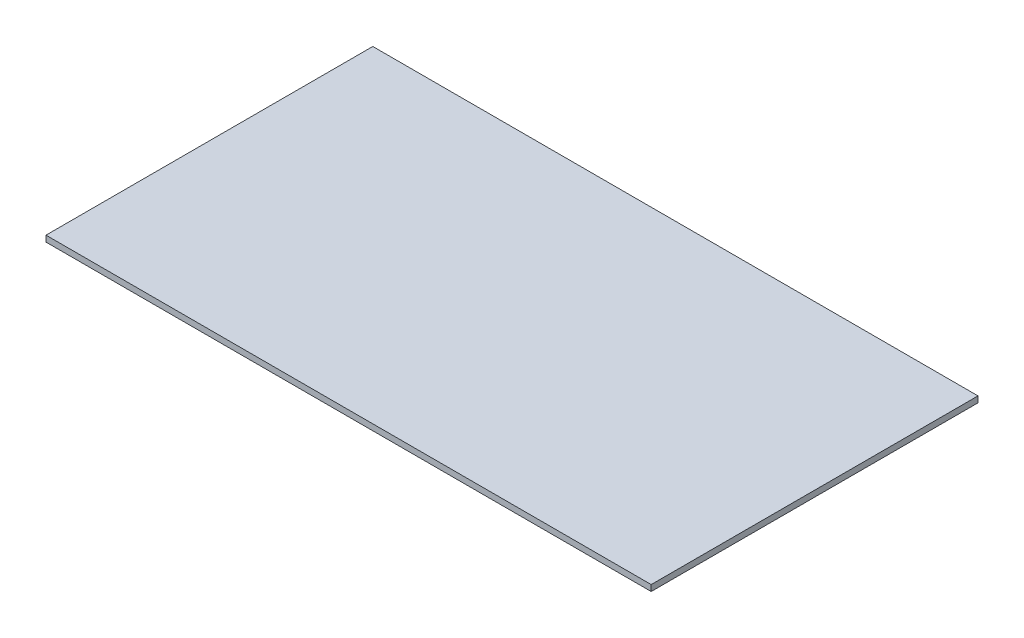
ISO-10303-21;
HEADER;
FILE_DESCRIPTION(('STEP AP214'),'2;1');
FILE_NAME('part.step','',(''),(''),'','','');
FILE_SCHEMA(('AUTOMOTIVE_DESIGN { 1 0 10303 214 1 1 1 1 }'));
ENDSEC;
DATA;
#1=APPLICATION_CONTEXT('core data for automotive mechanical design processes');
#2=APPLICATION_PROTOCOL_DEFINITION('international standard','automotive_design',2000,#1);
#3=PRODUCT_CONTEXT('',#1,'mechanical');
#4=PRODUCT('Part','Part','',(#3));
#5=PRODUCT_RELATED_PRODUCT_CATEGORY('part','',(#4));
#6=PRODUCT_DEFINITION_FORMATION('','',#4);
#7=PRODUCT_DEFINITION_CONTEXT('part definition',#1,'design');
#8=PRODUCT_DEFINITION('design','',#6,#7);
#9=PRODUCT_DEFINITION_SHAPE('','',#8);
#10=(LENGTH_UNIT() NAMED_UNIT(*) SI_UNIT(.MILLI.,.METRE.));
#11=(NAMED_UNIT(*) PLANE_ANGLE_UNIT() SI_UNIT($,.RADIAN.));
#12=(NAMED_UNIT(*) SI_UNIT($,.STERADIAN.) SOLID_ANGLE_UNIT());
#13=UNCERTAINTY_MEASURE_WITH_UNIT(LENGTH_MEASURE(1.E-05),#10,'distance_accuracy_value','');
#14=(GEOMETRIC_REPRESENTATION_CONTEXT(3) GLOBAL_UNCERTAINTY_ASSIGNED_CONTEXT((#13)) GLOBAL_UNIT_ASSIGNED_CONTEXT((#10,
#11,#12)) REPRESENTATION_CONTEXT('',''));
#15=CARTESIAN_POINT('',(0.,0.,0.));
#16=DIRECTION('',(0.,0.,1.));
#17=DIRECTION('',(1.,0.,0.));
#18=AXIS2_PLACEMENT_3D('',#15,#16,#17);
#19=CARTESIAN_POINT('',(500.,10.,270.));
#20=DIRECTION('',(-1.,0.,0.));
#21=DIRECTION('',(0.,0.,1.));
#22=AXIS2_PLACEMENT_3D('',#19,#20,#21);
#23=PLANE('',#22);
#24=DIRECTION('',(0.,0.,-1.));
#25=VECTOR('',#24,1.);
#26=CARTESIAN_POINT('',(500.,0.,270.));
#27=LINE('',#26,#25);
#28=CARTESIAN_POINT('',(500.,0.,270.));
#29=VERTEX_POINT('',#28);
#30=CARTESIAN_POINT('',(500.,0.,-270.));
#31=VERTEX_POINT('',#30);
#32=EDGE_CURVE('E107',#29,#31,#27,.T.);
#33=ORIENTED_EDGE('',*,*,#32,.T.);
#34=DIRECTION('',(0.,-1.,0.));
#35=VECTOR('',#34,1.);
#36=CARTESIAN_POINT('',(500.,10.,-270.));
#37=LINE('',#36,#35);
#38=CARTESIAN_POINT('',(500.,10.,-270.));
#39=VERTEX_POINT('',#38);
#40=EDGE_CURVE('E11',#39,#31,#37,.T.);
#41=ORIENTED_EDGE('',*,*,#40,.F.);
#42=DIRECTION('',(0.,0.,-1.));
#43=VECTOR('',#42,1.);
#44=CARTESIAN_POINT('',(500.,10.,270.));
#45=LINE('',#44,#43);
#46=CARTESIAN_POINT('',(500.,10.,270.));
#47=VERTEX_POINT('',#46);
#48=EDGE_CURVE('E91',#47,#39,#45,.T.);
#49=ORIENTED_EDGE('',*,*,#48,.F.);
#50=DIRECTION('',(0.,-1.,0.));
#51=VECTOR('',#50,1.);
#52=CARTESIAN_POINT('',(500.,10.,270.));
#53=LINE('',#52,#51);
#54=EDGE_CURVE('E103',#47,#29,#53,.T.);
#55=ORIENTED_EDGE('',*,*,#54,.T.);
#56=EDGE_LOOP('',(#33,#41,#49,#55));
#57=FACE_BOUND('',#56,.T.);
#58=ADVANCED_FACE('F39',(#57),#23,.F.);
#59=CARTESIAN_POINT('',(-500.,10.,-270.));
#60=DIRECTION('',(0.,0.,1.));
#61=DIRECTION('',(1.,0.,0.));
#62=AXIS2_PLACEMENT_3D('',#59,#60,#61);
#63=PLANE('',#62);
#64=DIRECTION('',(-1.,0.,0.));
#65=VECTOR('',#64,1.);
#66=CARTESIAN_POINT('',(-500.,0.,-270.));
#67=LINE('',#66,#65);
#68=CARTESIAN_POINT('',(-500.,0.,-270.));
#69=VERTEX_POINT('',#68);
#70=EDGE_CURVE('E96',#31,#69,#67,.T.);
#71=ORIENTED_EDGE('',*,*,#70,.T.);
#72=DIRECTION('',(0.,-1.,0.));
#73=VECTOR('',#72,1.);
#74=CARTESIAN_POINT('',(-500.,10.,-270.));
#75=LINE('',#74,#73);
#76=CARTESIAN_POINT('',(-500.,10.,-270.));
#77=VERTEX_POINT('',#76);
#78=EDGE_CURVE('E48',#77,#69,#75,.T.);
#79=ORIENTED_EDGE('',*,*,#78,.F.);
#80=DIRECTION('',(-1.,0.,0.));
#81=VECTOR('',#80,1.);
#82=CARTESIAN_POINT('',(-500.,10.,-270.));
#83=LINE('',#82,#81);
#84=EDGE_CURVE('E86',#39,#77,#83,.T.);
#85=ORIENTED_EDGE('',*,*,#84,.F.);
#86=ORIENTED_EDGE('',*,*,#40,.T.);
#87=EDGE_LOOP('',(#71,#79,#85,#86));
#88=FACE_BOUND('',#87,.T.);
#89=ADVANCED_FACE('F95',(#88),#63,.F.);
#90=CARTESIAN_POINT('',(-500.,10.,270.));
#91=DIRECTION('',(1.,0.,0.));
#92=DIRECTION('',(0.,0.,-1.));
#93=AXIS2_PLACEMENT_3D('',#90,#91,#92);
#94=PLANE('',#93);
#95=DIRECTION('',(0.,0.,1.));
#96=VECTOR('',#95,1.);
#97=CARTESIAN_POINT('',(-500.,0.,270.));
#98=LINE('',#97,#96);
#99=CARTESIAN_POINT('',(-500.,0.,270.));
#100=VERTEX_POINT('',#99);
#101=EDGE_CURVE('E73',#69,#100,#98,.T.);
#102=ORIENTED_EDGE('',*,*,#101,.T.);
#103=DIRECTION('',(0.,-1.,0.));
#104=VECTOR('',#103,1.);
#105=CARTESIAN_POINT('',(-500.,10.,270.));
#106=LINE('',#105,#104);
#107=CARTESIAN_POINT('',(-500.,10.,270.));
#108=VERTEX_POINT('',#107);
#109=EDGE_CURVE('E98',#108,#100,#106,.T.);
#110=ORIENTED_EDGE('',*,*,#109,.F.);
#111=DIRECTION('',(0.,0.,1.));
#112=VECTOR('',#111,1.);
#113=CARTESIAN_POINT('',(-500.,10.,270.));
#114=LINE('',#113,#112);
#115=EDGE_CURVE('E89',#77,#108,#114,.T.);
#116=ORIENTED_EDGE('',*,*,#115,.F.);
#117=ORIENTED_EDGE('',*,*,#78,.T.);
#118=EDGE_LOOP('',(#102,#110,#116,#117));
#119=FACE_BOUND('',#118,.T.);
#120=ADVANCED_FACE('F99',(#119),#94,.F.);
#121=CARTESIAN_POINT('',(-500.,10.,270.));
#122=DIRECTION('',(0.,0.,-1.));
#123=DIRECTION('',(-1.,0.,0.));
#124=AXIS2_PLACEMENT_3D('',#121,#122,#123);
#125=PLANE('',#124);
#126=DIRECTION('',(1.,0.,0.));
#127=VECTOR('',#126,1.);
#128=CARTESIAN_POINT('',(-500.,0.,270.));
#129=LINE('',#128,#127);
#130=EDGE_CURVE('E79',#100,#29,#129,.T.);
#131=ORIENTED_EDGE('',*,*,#130,.T.);
#132=ORIENTED_EDGE('',*,*,#54,.F.);
#133=DIRECTION('',(1.,0.,0.));
#134=VECTOR('',#133,1.);
#135=CARTESIAN_POINT('',(-500.,10.,270.));
#136=LINE('',#135,#134);
#137=EDGE_CURVE('E56',#108,#47,#136,.T.);
#138=ORIENTED_EDGE('',*,*,#137,.F.);
#139=ORIENTED_EDGE('',*,*,#109,.T.);
#140=EDGE_LOOP('',(#131,#132,#138,#139));
#141=FACE_BOUND('',#140,.T.);
#142=ADVANCED_FACE('F120',(#141),#125,.F.);
#143=CARTESIAN_POINT('',(0.,10.,0.));
#144=DIRECTION('',(0.,-1.,0.));
#145=DIRECTION('',(0.,0.,-1.));
#146=AXIS2_PLACEMENT_3D('',#143,#144,#145);
#147=PLANE('',#146);
#148=ORIENTED_EDGE('',*,*,#48,.T.);
#149=ORIENTED_EDGE('',*,*,#84,.T.);
#150=ORIENTED_EDGE('',*,*,#115,.T.);
#151=ORIENTED_EDGE('',*,*,#137,.T.);
#152=EDGE_LOOP('',(#148,#149,#150,#151));
#153=FACE_BOUND('',#152,.T.);
#154=ADVANCED_FACE('F87',(#153),#147,.F.);
#155=CARTESIAN_POINT('',(0.,0.,0.));
#156=DIRECTION('',(0.,-1.,0.));
#157=DIRECTION('',(0.,0.,-1.));
#158=AXIS2_PLACEMENT_3D('',#155,#156,#157);
#159=PLANE('',#158);
#160=ORIENTED_EDGE('',*,*,#32,.F.);
#161=ORIENTED_EDGE('',*,*,#130,.F.);
#162=ORIENTED_EDGE('',*,*,#101,.F.);
#163=ORIENTED_EDGE('',*,*,#70,.F.);
#164=EDGE_LOOP('',(#160,#161,#162,#163));
#165=FACE_BOUND('',#164,.T.);
#166=ADVANCED_FACE('F123',(#165),#159,.T.);
#167=CLOSED_SHELL('',(#58,#89,#120,#142,#154,#166));
#168=MANIFOLD_SOLID_BREP('B2',#167);
#169=ADVANCED_BREP_SHAPE_REPRESENTATION('',(#18,#168),#14);
#170=SHAPE_DEFINITION_REPRESENTATION(#9,#169);
ENDSEC;
END-ISO-10303-21;
